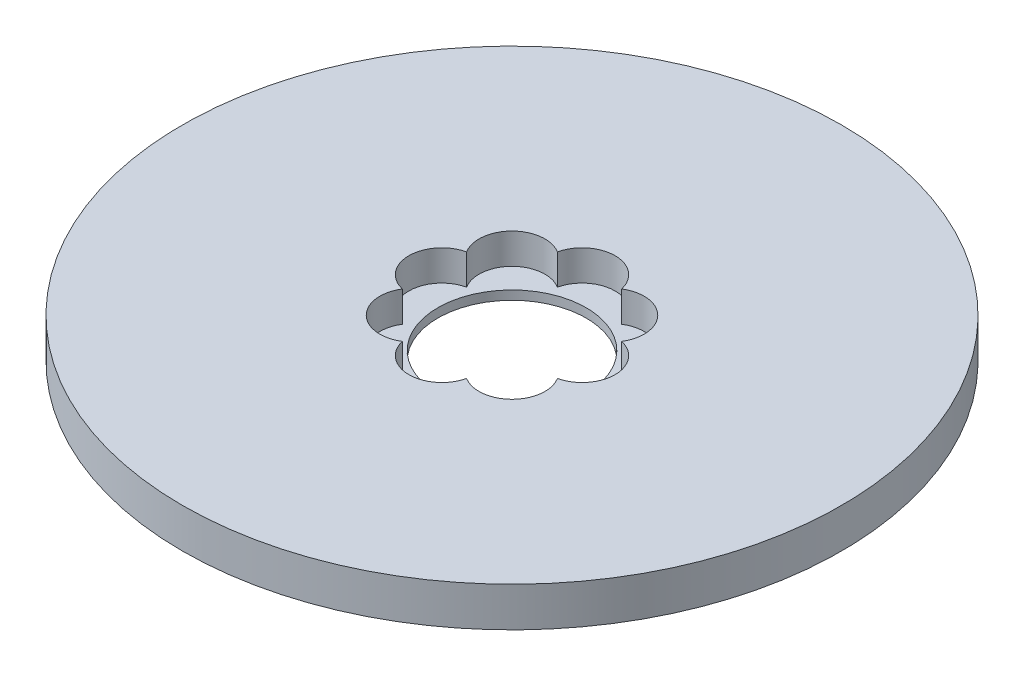
ISO-10303-21;
HEADER;
FILE_DESCRIPTION(('STEP AP214'),'2;1');
FILE_NAME('part.step','',(''),(''),'','','');
FILE_SCHEMA(('AUTOMOTIVE_DESIGN { 1 0 10303 214 1 1 1 1 }'));
ENDSEC;
DATA;
#1=APPLICATION_CONTEXT('core data for automotive mechanical design processes');
#2=APPLICATION_PROTOCOL_DEFINITION('international standard','automotive_design',2000,#1);
#3=PRODUCT_CONTEXT('',#1,'mechanical');
#4=PRODUCT('Part','Part','',(#3));
#5=PRODUCT_RELATED_PRODUCT_CATEGORY('part','',(#4));
#6=PRODUCT_DEFINITION_FORMATION('','',#4);
#7=PRODUCT_DEFINITION_CONTEXT('part definition',#1,'design');
#8=PRODUCT_DEFINITION('design','',#6,#7);
#9=PRODUCT_DEFINITION_SHAPE('','',#8);
#10=(LENGTH_UNIT() NAMED_UNIT(*) SI_UNIT(.MILLI.,.METRE.));
#11=(NAMED_UNIT(*) PLANE_ANGLE_UNIT() SI_UNIT($,.RADIAN.));
#12=(NAMED_UNIT(*) SI_UNIT($,.STERADIAN.) SOLID_ANGLE_UNIT());
#13=UNCERTAINTY_MEASURE_WITH_UNIT(LENGTH_MEASURE(1.E-05),#10,'distance_accuracy_value','');
#14=(GEOMETRIC_REPRESENTATION_CONTEXT(3) GLOBAL_UNCERTAINTY_ASSIGNED_CONTEXT((#13)) GLOBAL_UNIT_ASSIGNED_CONTEXT((#10,
#11,#12)) REPRESENTATION_CONTEXT('',''));
#15=CARTESIAN_POINT('',(0.,0.,0.));
#16=DIRECTION('',(0.,0.,1.));
#17=DIRECTION('',(1.,0.,0.));
#18=AXIS2_PLACEMENT_3D('',#15,#16,#17);
#19=CARTESIAN_POINT('',(0.,12.,0.));
#20=DIRECTION('',(0.,-1.,0.));
#21=DIRECTION('',(0.,0.,-1.));
#22=AXIS2_PLACEMENT_3D('',#19,#20,#21);
#23=CYLINDRICAL_SURFACE('',#22,22.5);
#24=CARTESIAN_POINT('',(0.,0.,0.));
#25=DIRECTION('',(0.,1.,0.));
#26=DIRECTION('',(0.,0.,1.));
#27=AXIS2_PLACEMENT_3D('',#24,#25,#26);
#28=CIRCLE('',#27,22.5);
#29=CARTESIAN_POINT('',(0.,0.,22.5));
#30=VERTEX_POINT('',#29);
#31=EDGE_CURVE('E166',#30,#30,#28,.T.);
#32=ORIENTED_EDGE('',*,*,#31,.F.);
#33=EDGE_LOOP('',(#32));
#34=FACE_BOUND('',#33,.T.);
#35=CARTESIAN_POINT('',(0.,2.72574699490069,0.));
#36=DIRECTION('',(0.,1.,0.));
#37=DIRECTION('',(0.,0.,1.));
#38=AXIS2_PLACEMENT_3D('',#35,#36,#37);
#39=CIRCLE('',#38,22.5);
#40=CARTESIAN_POINT('',(0.,2.72574699490069,22.5));
#41=VERTEX_POINT('',#40);
#42=EDGE_CURVE('E11',#41,#41,#39,.T.);
#43=ORIENTED_EDGE('',*,*,#42,.T.);
#44=EDGE_LOOP('',(#43));
#45=FACE_BOUND('',#44,.T.);
#46=ADVANCED_FACE('F39',(#34,#45),#23,.F.);
#47=CARTESIAN_POINT('',(0.,12.,0.));
#48=DIRECTION('',(0.,-1.,0.));
#49=DIRECTION('',(0.,0.,-1.));
#50=AXIS2_PLACEMENT_3D('',#47,#48,#49);
#51=CYLINDRICAL_SURFACE('',#50,100.);
#52=CARTESIAN_POINT('',(0.,12.,0.));
#53=DIRECTION('',(0.,1.,0.));
#54=DIRECTION('',(0.,0.,1.));
#55=AXIS2_PLACEMENT_3D('',#52,#53,#54);
#56=CIRCLE('',#55,100.);
#57=CARTESIAN_POINT('',(0.,12.,100.));
#58=VERTEX_POINT('',#57);
#59=EDGE_CURVE('E50',#58,#58,#56,.T.);
#60=ORIENTED_EDGE('',*,*,#59,.F.);
#61=EDGE_LOOP('',(#60));
#62=FACE_BOUND('',#61,.T.);
#63=CARTESIAN_POINT('',(0.,0.,0.));
#64=DIRECTION('',(0.,1.,0.));
#65=DIRECTION('',(0.,0.,1.));
#66=AXIS2_PLACEMENT_3D('',#63,#64,#65);
#67=CIRCLE('',#66,100.);
#68=CARTESIAN_POINT('',(0.,0.,100.));
#69=VERTEX_POINT('',#68);
#70=EDGE_CURVE('E173',#69,#69,#67,.T.);
#71=ORIENTED_EDGE('',*,*,#70,.T.);
#72=EDGE_LOOP('',(#71));
#73=FACE_BOUND('',#72,.T.);
#74=ADVANCED_FACE('F41',(#62,#73),#51,.T.);
#75=CARTESIAN_POINT('',(0.,12.,0.));
#76=DIRECTION('',(0.,1.,0.));
#77=DIRECTION('',(0.,0.,1.));
#78=AXIS2_PLACEMENT_3D('',#75,#76,#77);
#79=PLANE('',#78);
#80=CARTESIAN_POINT('',(-15.0452953096773,12.,15.0452953096773));
#81=DIRECTION('',(0.,1.,0.));
#82=DIRECTION('',(0.707106781186549,0.,0.707106781186546));
#83=AXIS2_PLACEMENT_3D('',#80,#81,#82);
#84=CIRCLE('',#83,10.);
#85=CARTESIAN_POINT('',(-23.5245895934319,12.,9.74420405886048));
#86=VERTEX_POINT('',#85);
#87=CARTESIAN_POINT('',(-9.74420405886039,12.,23.5245895934319));
#88=VERTEX_POINT('',#87);
#89=EDGE_CURVE('E159',#86,#88,#84,.T.);
#90=ORIENTED_EDGE('',*,*,#89,.F.);
#91=CARTESIAN_POINT('',(-21.277260676854,12.,0.));
#92=DIRECTION('',(0.,1.,0.));
#93=DIRECTION('',(0.,0.,1.));
#94=AXIS2_PLACEMENT_3D('',#91,#92,#93);
#95=CIRCLE('',#94,10.);
#96=CARTESIAN_POINT('',(-23.5245895934322,12.,-9.74420405886041));
#97=VERTEX_POINT('',#96);
#98=EDGE_CURVE('E167',#97,#86,#95,.T.);
#99=ORIENTED_EDGE('',*,*,#98,.F.);
#100=CARTESIAN_POINT('',(-15.0452953096775,12.,-15.0452953096771));
#101=DIRECTION('',(0.,1.,0.));
#102=DIRECTION('',(-0.707106781186539,0.,0.707106781186556));
#103=AXIS2_PLACEMENT_3D('',#100,#101,#102);
#104=CIRCLE('',#103,10.);
#105=CARTESIAN_POINT('',(-9.74420405886072,12.,-23.5245895934318));
#106=VERTEX_POINT('',#105);
#107=EDGE_CURVE('E53',#106,#97,#104,.T.);
#108=ORIENTED_EDGE('',*,*,#107,.F.);
#109=CARTESIAN_POINT('',(-2.2286747578481E-13,12.,-21.277260676854));
#110=DIRECTION('',(0.,1.,0.));
#111=DIRECTION('',(-1.,0.,0.));
#112=AXIS2_PLACEMENT_3D('',#109,#110,#111);
#113=CIRCLE('',#112,10.);
#114=CARTESIAN_POINT('',(9.74420405886023,12.,-23.524589593432));
#115=VERTEX_POINT('',#114);
#116=EDGE_CURVE('E117',#115,#106,#113,.T.);
#117=ORIENTED_EDGE('',*,*,#116,.F.);
#118=CARTESIAN_POINT('',(15.0452953096772,12.,-15.0452953096775));
#119=DIRECTION('',(0.,1.,0.));
#120=DIRECTION('',(-0.707106781186554,0.,-0.707106781186541));
#121=AXIS2_PLACEMENT_3D('',#118,#119,#120);
#122=CIRCLE('',#121,10.);
#123=CARTESIAN_POINT('',(23.5245895934317,12.,-9.74420405886051));
#124=VERTEX_POINT('',#123);
#125=EDGE_CURVE('E120',#124,#115,#122,.T.);
#126=ORIENTED_EDGE('',*,*,#125,.F.);
#127=CARTESIAN_POINT('',(21.277260676854,12.,0.));
#128=DIRECTION('',(0.,1.,0.));
#129=DIRECTION('',(0.,0.,-1.));
#130=AXIS2_PLACEMENT_3D('',#127,#128,#129);
#131=CIRCLE('',#130,10.);
#132=CARTESIAN_POINT('',(23.524589593432,12.,9.74420405886044));
#133=VERTEX_POINT('',#132);
#134=EDGE_CURVE('E136',#133,#124,#131,.T.);
#135=ORIENTED_EDGE('',*,*,#134,.F.);
#136=CARTESIAN_POINT('',(15.0452953096774,12.,15.0452953096772));
#137=DIRECTION('',(0.,1.,0.));
#138=DIRECTION('',(0.707106781186544,0.,-0.707106781186551));
#139=AXIS2_PLACEMENT_3D('',#136,#137,#138);
#140=CIRCLE('',#139,10.);
#141=CARTESIAN_POINT('',(9.74420405886056,12.,23.5245895934318));
#142=VERTEX_POINT('',#141);
#143=EDGE_CURVE('E138',#142,#133,#140,.T.);
#144=ORIENTED_EDGE('',*,*,#143,.F.);
#145=CARTESIAN_POINT('',(0.,12.,21.277260676854));
#146=DIRECTION('',(0.,1.,0.));
#147=DIRECTION('',(1.,0.,0.));
#148=AXIS2_PLACEMENT_3D('',#145,#146,#147);
#149=CIRCLE('',#148,10.);
#150=EDGE_CURVE('E146',#88,#142,#149,.T.);
#151=ORIENTED_EDGE('',*,*,#150,.F.);
#152=EDGE_LOOP('',(#90,#99,#108,#117,#126,#135,#144,#151));
#153=FACE_BOUND('',#152,.T.);
#154=ORIENTED_EDGE('',*,*,#59,.T.);
#155=EDGE_LOOP('',(#154));
#156=FACE_BOUND('',#155,.T.);
#157=ADVANCED_FACE('F181',(#153,#156),#79,.T.);
#158=CARTESIAN_POINT('',(0.,0.,0.));
#159=DIRECTION('',(0.,1.,0.));
#160=DIRECTION('',(0.,0.,1.));
#161=AXIS2_PLACEMENT_3D('',#158,#159,#160);
#162=PLANE('',#161);
#163=ORIENTED_EDGE('',*,*,#31,.T.);
#164=EDGE_LOOP('',(#163));
#165=FACE_BOUND('',#164,.T.);
#166=ORIENTED_EDGE('',*,*,#70,.F.);
#167=EDGE_LOOP('',(#166));
#168=FACE_BOUND('',#167,.T.);
#169=ADVANCED_FACE('F179',(#165,#168),#162,.F.);
#170=CARTESIAN_POINT('',(-21.277260676854,2.72574699490069,0.));
#171=DIRECTION('',(0.,1.,0.));
#172=DIRECTION('',(0.,0.,1.));
#173=AXIS2_PLACEMENT_3D('',#170,#171,#172);
#174=CYLINDRICAL_SURFACE('',#173,10.);
#175=ORIENTED_EDGE('',*,*,#98,.T.);
#176=DIRECTION('',(0.,1.,0.));
#177=VECTOR('',#176,1.);
#178=CARTESIAN_POINT('',(-23.5245895934319,7.36287349745035,9.74420405886048));
#179=LINE('',#178,#177);
#180=CARTESIAN_POINT('',(-23.5245895934319,2.72574699490069,9.74420405886048));
#181=VERTEX_POINT('',#180);
#182=EDGE_CURVE('E65',#86,#181,#179,.F.);
#183=ORIENTED_EDGE('',*,*,#182,.T.);
#184=CARTESIAN_POINT('',(-21.277260676854,2.72574699490069,0.));
#185=DIRECTION('',(0.,1.,0.));
#186=DIRECTION('',(0.,0.,1.));
#187=AXIS2_PLACEMENT_3D('',#184,#185,#186);
#188=CIRCLE('',#187,10.);
#189=CARTESIAN_POINT('',(-23.5245895934322,2.72574699490069,-9.74420405886041));
#190=VERTEX_POINT('',#189);
#191=EDGE_CURVE('E170',#190,#181,#188,.T.);
#192=ORIENTED_EDGE('',*,*,#191,.F.);
#193=DIRECTION('',(0.,1.,0.));
#194=VECTOR('',#193,1.);
#195=CARTESIAN_POINT('',(-23.5245895934322,7.36287349745035,-9.74420405886041));
#196=LINE('',#195,#194);
#197=EDGE_CURVE('E124',#190,#97,#196,.T.);
#198=ORIENTED_EDGE('',*,*,#197,.T.);
#199=EDGE_LOOP('',(#175,#183,#192,#198));
#200=FACE_BOUND('',#199,.T.);
#201=ADVANCED_FACE('F185',(#200),#174,.F.);
#202=CARTESIAN_POINT('',(-21.277260676854,2.72574699490069,0.));
#203=DIRECTION('',(0.,1.,0.));
#204=DIRECTION('',(0.,0.,1.));
#205=AXIS2_PLACEMENT_3D('',#202,#203,#204);
#206=PLANE('',#205);
#207=CARTESIAN_POINT('',(-15.0452953096775,2.72574699490069,-15.0452953096771));
#208=DIRECTION('',(0.,1.,0.));
#209=DIRECTION('',(-0.707106781186539,0.,0.707106781186556));
#210=AXIS2_PLACEMENT_3D('',#207,#208,#209);
#211=CIRCLE('',#210,10.);
#212=CARTESIAN_POINT('',(-9.74420405886072,2.72574699490069,-23.5245895934318));
#213=VERTEX_POINT('',#212);
#214=EDGE_CURVE('E112',#213,#190,#211,.T.);
#215=ORIENTED_EDGE('',*,*,#214,.T.);
#216=ORIENTED_EDGE('',*,*,#191,.T.);
#217=CARTESIAN_POINT('',(-15.0452953096773,2.72574699490069,15.0452953096773));
#218=DIRECTION('',(0.,1.,0.));
#219=DIRECTION('',(0.707106781186549,0.,0.707106781186546));
#220=AXIS2_PLACEMENT_3D('',#217,#218,#219);
#221=CIRCLE('',#220,10.);
#222=CARTESIAN_POINT('',(-9.74420405886039,2.72574699490069,23.5245895934319));
#223=VERTEX_POINT('',#222);
#224=EDGE_CURVE('E161',#181,#223,#221,.T.);
#225=ORIENTED_EDGE('',*,*,#224,.T.);
#226=CARTESIAN_POINT('',(0.,2.72574699490069,21.277260676854));
#227=DIRECTION('',(0.,1.,0.));
#228=DIRECTION('',(1.,0.,0.));
#229=AXIS2_PLACEMENT_3D('',#226,#227,#228);
#230=CIRCLE('',#229,10.);
#231=CARTESIAN_POINT('',(9.74420405886056,2.72574699490069,23.5245895934318));
#232=VERTEX_POINT('',#231);
#233=EDGE_CURVE('E149',#223,#232,#230,.T.);
#234=ORIENTED_EDGE('',*,*,#233,.T.);
#235=CARTESIAN_POINT('',(15.0452953096774,2.72574699490069,15.0452953096772));
#236=DIRECTION('',(0.,1.,0.));
#237=DIRECTION('',(0.707106781186544,0.,-0.707106781186551));
#238=AXIS2_PLACEMENT_3D('',#235,#236,#237);
#239=CIRCLE('',#238,10.);
#240=CARTESIAN_POINT('',(23.524589593432,2.72574699490069,9.74420405886044));
#241=VERTEX_POINT('',#240);
#242=EDGE_CURVE('E143',#232,#241,#239,.T.);
#243=ORIENTED_EDGE('',*,*,#242,.T.);
#244=CARTESIAN_POINT('',(21.277260676854,2.72574699490069,0.));
#245=DIRECTION('',(0.,1.,0.));
#246=DIRECTION('',(0.,0.,-1.));
#247=AXIS2_PLACEMENT_3D('',#244,#245,#246);
#248=CIRCLE('',#247,10.);
#249=CARTESIAN_POINT('',(23.5245895934317,2.72574699490069,-9.74420405886051));
#250=VERTEX_POINT('',#249);
#251=EDGE_CURVE('E140',#241,#250,#248,.T.);
#252=ORIENTED_EDGE('',*,*,#251,.T.);
#253=CARTESIAN_POINT('',(15.0452953096772,2.72574699490069,-15.0452953096775));
#254=DIRECTION('',(0.,1.,0.));
#255=DIRECTION('',(-0.707106781186554,0.,-0.707106781186541));
#256=AXIS2_PLACEMENT_3D('',#253,#254,#255);
#257=CIRCLE('',#256,10.);
#258=CARTESIAN_POINT('',(9.74420405886023,2.72574699490069,-23.524589593432));
#259=VERTEX_POINT('',#258);
#260=EDGE_CURVE('E111',#250,#259,#257,.T.);
#261=ORIENTED_EDGE('',*,*,#260,.T.);
#262=CARTESIAN_POINT('',(-2.2286747578481E-13,2.72574699490069,-21.277260676854));
#263=DIRECTION('',(0.,1.,0.));
#264=DIRECTION('',(-1.,0.,0.));
#265=AXIS2_PLACEMENT_3D('',#262,#263,#264);
#266=CIRCLE('',#265,10.);
#267=EDGE_CURVE('E104',#259,#213,#266,.T.);
#268=ORIENTED_EDGE('',*,*,#267,.T.);
#269=EDGE_LOOP('',(#215,#216,#225,#234,#243,#252,#261,#268));
#270=FACE_BOUND('',#269,.T.);
#271=ORIENTED_EDGE('',*,*,#42,.F.);
#272=EDGE_LOOP('',(#271));
#273=FACE_BOUND('',#272,.T.);
#274=ADVANCED_FACE('F110',(#270,#273),#206,.T.);
#275=CARTESIAN_POINT('',(-15.0452953096773,2.72574699490069,15.0452953096773));
#276=DIRECTION('',(0.,1.,0.));
#277=DIRECTION('',(0.,0.,1.));
#278=AXIS2_PLACEMENT_3D('',#275,#276,#277);
#279=CYLINDRICAL_SURFACE('',#278,10.);
#280=ORIENTED_EDGE('',*,*,#89,.T.);
#281=DIRECTION('',(0.,1.,0.));
#282=VECTOR('',#281,1.);
#283=CARTESIAN_POINT('',(-9.74420405886039,7.36287349745035,23.5245895934319));
#284=LINE('',#283,#282);
#285=EDGE_CURVE('E160',#88,#223,#284,.F.);
#286=ORIENTED_EDGE('',*,*,#285,.T.);
#287=ORIENTED_EDGE('',*,*,#224,.F.);
#288=ORIENTED_EDGE('',*,*,#182,.F.);
#289=EDGE_LOOP('',(#280,#286,#287,#288));
#290=FACE_BOUND('',#289,.T.);
#291=ADVANCED_FACE('F202',(#290),#279,.F.);
#292=CARTESIAN_POINT('',(-15.0452953096775,2.72574699490069,-15.0452953096771));
#293=DIRECTION('',(0.,1.,0.));
#294=DIRECTION('',(0.,0.,1.));
#295=AXIS2_PLACEMENT_3D('',#292,#293,#294);
#296=CYLINDRICAL_SURFACE('',#295,10.);
#297=ORIENTED_EDGE('',*,*,#214,.F.);
#298=DIRECTION('',(0.,1.,0.));
#299=VECTOR('',#298,1.);
#300=CARTESIAN_POINT('',(-9.74420405886072,7.36287349745035,-23.5245895934318));
#301=LINE('',#300,#299);
#302=EDGE_CURVE('E119',#106,#213,#301,.F.);
#303=ORIENTED_EDGE('',*,*,#302,.F.);
#304=ORIENTED_EDGE('',*,*,#107,.T.);
#305=ORIENTED_EDGE('',*,*,#197,.F.);
#306=EDGE_LOOP('',(#297,#303,#304,#305));
#307=FACE_BOUND('',#306,.T.);
#308=ADVANCED_FACE('F123',(#307),#296,.F.);
#309=CARTESIAN_POINT('',(0.,2.72574699490069,21.277260676854));
#310=DIRECTION('',(0.,1.,0.));
#311=DIRECTION('',(0.,0.,1.));
#312=AXIS2_PLACEMENT_3D('',#309,#310,#311);
#313=CYLINDRICAL_SURFACE('',#312,10.);
#314=ORIENTED_EDGE('',*,*,#150,.T.);
#315=DIRECTION('',(0.,1.,0.));
#316=VECTOR('',#315,1.);
#317=CARTESIAN_POINT('',(9.74420405886056,7.36287349745035,23.5245895934318));
#318=LINE('',#317,#316);
#319=EDGE_CURVE('E141',#142,#232,#318,.F.);
#320=ORIENTED_EDGE('',*,*,#319,.T.);
#321=ORIENTED_EDGE('',*,*,#233,.F.);
#322=ORIENTED_EDGE('',*,*,#285,.F.);
#323=EDGE_LOOP('',(#314,#320,#321,#322));
#324=FACE_BOUND('',#323,.T.);
#325=ADVANCED_FACE('F208',(#324),#313,.F.);
#326=CARTESIAN_POINT('',(15.0452953096774,2.72574699490069,15.0452953096772));
#327=DIRECTION('',(0.,1.,0.));
#328=DIRECTION('',(0.,0.,1.));
#329=AXIS2_PLACEMENT_3D('',#326,#327,#328);
#330=CYLINDRICAL_SURFACE('',#329,10.);
#331=DIRECTION('',(0.,1.,0.));
#332=VECTOR('',#331,1.);
#333=CARTESIAN_POINT('',(23.524589593432,7.36287349745035,9.74420405886044));
#334=LINE('',#333,#332);
#335=EDGE_CURVE('E151',#133,#241,#334,.F.);
#336=ORIENTED_EDGE('',*,*,#335,.T.);
#337=ORIENTED_EDGE('',*,*,#242,.F.);
#338=ORIENTED_EDGE('',*,*,#319,.F.);
#339=ORIENTED_EDGE('',*,*,#143,.T.);
#340=EDGE_LOOP('',(#336,#337,#338,#339));
#341=FACE_BOUND('',#340,.T.);
#342=ADVANCED_FACE('F211',(#341),#330,.F.);
#343=CARTESIAN_POINT('',(21.277260676854,2.72574699490069,0.));
#344=DIRECTION('',(0.,1.,0.));
#345=DIRECTION('',(0.,0.,1.));
#346=AXIS2_PLACEMENT_3D('',#343,#344,#345);
#347=CYLINDRICAL_SURFACE('',#346,10.);
#348=ORIENTED_EDGE('',*,*,#134,.T.);
#349=DIRECTION('',(0.,1.,0.));
#350=VECTOR('',#349,1.);
#351=CARTESIAN_POINT('',(23.5245895934317,7.36287349745035,-9.74420405886051));
#352=LINE('',#351,#350);
#353=EDGE_CURVE('E131',#124,#250,#352,.F.);
#354=ORIENTED_EDGE('',*,*,#353,.T.);
#355=ORIENTED_EDGE('',*,*,#251,.F.);
#356=ORIENTED_EDGE('',*,*,#335,.F.);
#357=EDGE_LOOP('',(#348,#354,#355,#356));
#358=FACE_BOUND('',#357,.T.);
#359=ADVANCED_FACE('F214',(#358),#347,.F.);
#360=CARTESIAN_POINT('',(15.0452953096772,2.72574699490069,-15.0452953096775));
#361=DIRECTION('',(0.,1.,0.));
#362=DIRECTION('',(0.,0.,1.));
#363=AXIS2_PLACEMENT_3D('',#360,#361,#362);
#364=CYLINDRICAL_SURFACE('',#363,10.);
#365=DIRECTION('',(0.,1.,0.));
#366=VECTOR('',#365,1.);
#367=CARTESIAN_POINT('',(9.74420405886023,7.36287349745035,-23.524589593432));
#368=LINE('',#367,#366);
#369=EDGE_CURVE('E154',#115,#259,#368,.F.);
#370=ORIENTED_EDGE('',*,*,#369,.T.);
#371=ORIENTED_EDGE('',*,*,#260,.F.);
#372=ORIENTED_EDGE('',*,*,#353,.F.);
#373=ORIENTED_EDGE('',*,*,#125,.T.);
#374=EDGE_LOOP('',(#370,#371,#372,#373));
#375=FACE_BOUND('',#374,.T.);
#376=ADVANCED_FACE('F218',(#375),#364,.F.);
#377=CARTESIAN_POINT('',(-2.2286747578481E-13,2.72574699490069,-21.277260676854));
#378=DIRECTION('',(0.,1.,0.));
#379=DIRECTION('',(0.,0.,1.));
#380=AXIS2_PLACEMENT_3D('',#377,#378,#379);
#381=CYLINDRICAL_SURFACE('',#380,10.);
#382=ORIENTED_EDGE('',*,*,#116,.T.);
#383=ORIENTED_EDGE('',*,*,#302,.T.);
#384=ORIENTED_EDGE('',*,*,#267,.F.);
#385=ORIENTED_EDGE('',*,*,#369,.F.);
#386=EDGE_LOOP('',(#382,#383,#384,#385));
#387=FACE_BOUND('',#386,.T.);
#388=ADVANCED_FACE('F121',(#387),#381,.F.);
#389=CLOSED_SHELL('',(#46,#74,#157,#169,#201,#274,#291,#308,#325,#342,#359,#376,#388));
#390=MANIFOLD_SOLID_BREP('B2',#389);
#391=ADVANCED_BREP_SHAPE_REPRESENTATION('',(#18,#390),#14);
#392=SHAPE_DEFINITION_REPRESENTATION(#9,#391);
ENDSEC;
END-ISO-10303-21;
